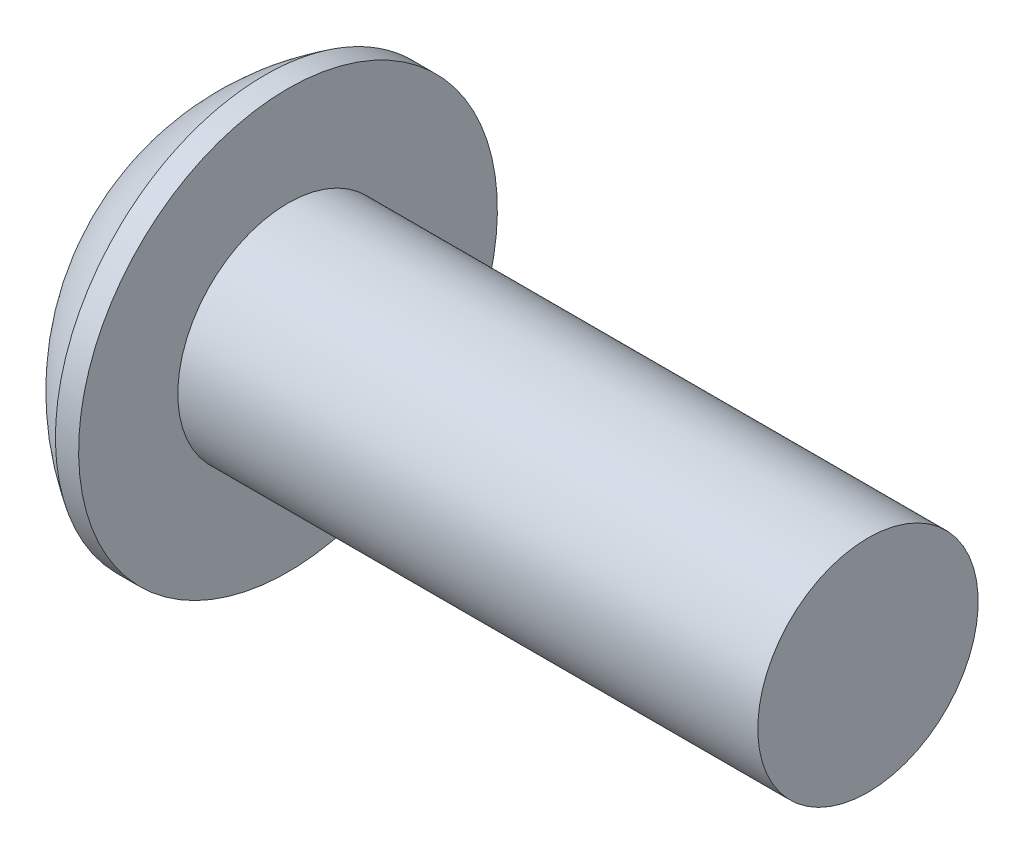
ISO-10303-21;
HEADER;
FILE_DESCRIPTION(('STEP AP214'),'2;1');
FILE_NAME('part.step','',(''),(''),'','','');
FILE_SCHEMA(('AUTOMOTIVE_DESIGN { 1 0 10303 214 1 1 1 1 }'));
ENDSEC;
DATA;
#1=APPLICATION_CONTEXT('core data for automotive mechanical design processes');
#2=APPLICATION_PROTOCOL_DEFINITION('international standard','automotive_design',2000,#1);
#3=PRODUCT_CONTEXT('',#1,'mechanical');
#4=PRODUCT('Part','Part','',(#3));
#5=PRODUCT_RELATED_PRODUCT_CATEGORY('part','',(#4));
#6=PRODUCT_DEFINITION_FORMATION('','',#4);
#7=PRODUCT_DEFINITION_CONTEXT('part definition',#1,'design');
#8=PRODUCT_DEFINITION('design','',#6,#7);
#9=PRODUCT_DEFINITION_SHAPE('','',#8);
#10=(LENGTH_UNIT() NAMED_UNIT(*) SI_UNIT(.MILLI.,.METRE.));
#11=(NAMED_UNIT(*) PLANE_ANGLE_UNIT() SI_UNIT($,.RADIAN.));
#12=(NAMED_UNIT(*) SI_UNIT($,.STERADIAN.) SOLID_ANGLE_UNIT());
#13=UNCERTAINTY_MEASURE_WITH_UNIT(LENGTH_MEASURE(1.E-05),#10,'distance_accuracy_value','');
#14=(GEOMETRIC_REPRESENTATION_CONTEXT(3) GLOBAL_UNCERTAINTY_ASSIGNED_CONTEXT((#13)) GLOBAL_UNIT_ASSIGNED_CONTEXT((#10,
#11,#12)) REPRESENTATION_CONTEXT('',''));
#15=CARTESIAN_POINT('',(0.,0.,0.));
#16=DIRECTION('',(0.,0.,1.));
#17=DIRECTION('',(1.,0.,0.));
#18=AXIS2_PLACEMENT_3D('',#15,#16,#17);
#19=CARTESIAN_POINT('',(-0.533400000000002,0.,0.));
#20=DIRECTION('',(-1.,0.,0.));
#21=DIRECTION('',(0.,0.,1.));
#22=AXIS2_PLACEMENT_3D('',#19,#20,#21);
#23=PLANE('',#22);
#24=DIRECTION('',(0.,0.5,0.866025403784439));
#25=VECTOR('',#24,1.);
#26=CARTESIAN_POINT('',(-0.533400000000002,1.83308710467706,0.));
#27=LINE('',#26,#25);
#28=CARTESIAN_POINT('',(-0.533400000000002,1.83308710467706,0.));
#29=VERTEX_POINT('',#28);
#30=CARTESIAN_POINT('',(-0.533400000000002,0.916543552338531,-1.5875));
#31=VERTEX_POINT('',#30);
#32=EDGE_CURVE('E116',#29,#31,#27,.F.);
#33=ORIENTED_EDGE('',*,*,#32,.T.);
#34=DIRECTION('',(0.,1.,0.));
#35=VECTOR('',#34,1.);
#36=CARTESIAN_POINT('',(-0.533400000000002,0.916543552338531,-1.5875));
#37=LINE('',#36,#35);
#38=CARTESIAN_POINT('',(-0.533400000000002,-0.916543552338531,-1.5875));
#39=VERTEX_POINT('',#38);
#40=EDGE_CURVE('E83',#31,#39,#37,.F.);
#41=ORIENTED_EDGE('',*,*,#40,.T.);
#42=DIRECTION('',(0.,0.5,-0.866025403784439));
#43=VECTOR('',#42,1.);
#44=CARTESIAN_POINT('',(-0.533400000000002,-0.916543552338531,-1.5875));
#45=LINE('',#44,#43);
#46=CARTESIAN_POINT('',(-0.533400000000002,-1.83308710467706,0.));
#47=VERTEX_POINT('',#46);
#48=EDGE_CURVE('E85',#39,#47,#45,.F.);
#49=ORIENTED_EDGE('',*,*,#48,.T.);
#50=DIRECTION('',(0.,-0.5,-0.866025403784439));
#51=VECTOR('',#50,1.);
#52=CARTESIAN_POINT('',(-0.533400000000002,-1.83308710467706,0.));
#53=LINE('',#52,#51);
#54=CARTESIAN_POINT('',(-0.533400000000002,-0.916543552338533,1.5875));
#55=VERTEX_POINT('',#54);
#56=EDGE_CURVE('E86',#47,#55,#53,.F.);
#57=ORIENTED_EDGE('',*,*,#56,.T.);
#58=DIRECTION('',(0.,-1.,0.));
#59=VECTOR('',#58,1.);
#60=CARTESIAN_POINT('',(-0.533400000000002,-0.916543552338532,1.5875));
#61=LINE('',#60,#59);
#62=CARTESIAN_POINT('',(-0.533400000000002,0.916543552338531,1.5875));
#63=VERTEX_POINT('',#62);
#64=EDGE_CURVE('E72',#55,#63,#61,.F.);
#65=ORIENTED_EDGE('',*,*,#64,.T.);
#66=DIRECTION('',(0.,-0.5,0.866025403784439));
#67=VECTOR('',#66,1.);
#68=CARTESIAN_POINT('',(-0.533400000000002,0.916543552338531,1.5875));
#69=LINE('',#68,#67);
#70=EDGE_CURVE('E111',#63,#29,#69,.F.);
#71=ORIENTED_EDGE('',*,*,#70,.T.);
#72=EDGE_LOOP('',(#33,#41,#49,#57,#65,#71));
#73=FACE_BOUND('',#72,.T.);
#74=ADVANCED_FACE('F17',(#73),#23,.T.);
#75=CARTESIAN_POINT('',(-0.533400000000002,-1.83308710467706,0.));
#76=DIRECTION('',(0.,-0.866025403784439,0.5));
#77=DIRECTION('',(0.,-0.5,-0.866025403784439));
#78=AXIS2_PLACEMENT_3D('',#75,#76,#77);
#79=PLANE('',#78);
#80=CARTESIAN_POINT('',(-2.56539999994394,-1.8330871046745,-2.00804498786736E-11));
#81=CARTESIAN_POINT('',(-2.53392818229741,-1.80158505518366,0.0545631502562923));
#82=CARTESIAN_POINT('',(-2.5043050627177,-1.76955629074211,0.110038597579172));
#83=CARTESIAN_POINT('',(-2.45006639539122,-1.70424635317817,0.223158727683824));
#84=CARTESIAN_POINT('',(-2.42548101615987,-1.6709589724711,0.280814162317604));
#85=CARTESIAN_POINT('',(-2.38336609605347,-1.60383660211837,0.397073518091736));
#86=CARTESIAN_POINT('',(-2.36573072948629,-1.57001869730198,0.455647847439699));
#87=CARTESIAN_POINT('',(-2.33856008862263,-1.50163859306838,0.574085662199493));
#88=CARTESIAN_POINT('',(-2.32900454007239,-1.46707848106388,0.633945532106421));
#89=CARTESIAN_POINT('',(-2.32038274183869,-1.40751253669323,0.737116774157155));
#90=CARTESIAN_POINT('',(-2.31910682172836,-1.38258360390154,0.780294952330845));
#91=CARTESIAN_POINT('',(-2.32125913780735,-1.33276652395073,0.866580665890379));
#92=CARTESIAN_POINT('',(-2.32468902284537,-1.30787839414808,0.90968817121394));
#93=CARTESIAN_POINT('',(-2.33605631415915,-1.25834345643267,0.995485200086784));
#94=CARTESIAN_POINT('',(-2.34399762019329,-1.23369687609494,1.03817432946455));
#95=CARTESIAN_POINT('',(-2.36395627681902,-1.18481740842653,1.12283605091316));
#96=CARTESIAN_POINT('',(-2.37597537628367,-1.16058470328902,1.16480832741616));
#97=CARTESIAN_POINT('',(-2.41164383187845,-1.09853862948576,1.27227527965358));
#98=CARTESIAN_POINT('',(-2.43797770752625,-1.06110942924036,1.33710455616529));
#99=CARTESIAN_POINT('',(-2.48243061452926,-1.00607390269188,1.43242888436855));
#100=CARTESIAN_POINT('',(-2.49804835924321,-0.987937988038022,1.46384120999077));
#101=CARTESIAN_POINT('',(-2.53070945051393,-0.951999508520197,1.52608848246242));
#102=CARTESIAN_POINT('',(-2.54775211871235,-0.934196789917587,1.55692369559499));
#103=CARTESIAN_POINT('',(-2.56539999993807,-0.916543552329633,1.58750000001541));
#104=B_SPLINE_CURVE_WITH_KNOTS('',3,(#80,#81,#82,#83,#84,#85,#86,#87,#88,#89,#90,#91,#92,#93,
#94,#95,#96,#97,#98,#99,#100,#101,#102,#103),.UNSPECIFIED.,.F.,.F.,(4,2,2,2,2,2,2,2,2,2,2,4),
(0.,0.211427927732169,0.424087197148228,0.633370156422424,0.842126401515785,0.991537201098734,
1.14100036552056,1.29059292577265,1.44024972414947,1.67781721417335,1.79627069411587,
1.91466809995991),.UNSPECIFIED.);
#105=CARTESIAN_POINT('',(-2.56539999993857,-1.83308710468646,0.));
#106=VERTEX_POINT('',#105);
#107=CARTESIAN_POINT('',(-2.56539999993106,-0.916543552342318,1.5875));
#108=VERTEX_POINT('',#107);
#109=EDGE_CURVE('E20',#106,#108,#104,.T.);
#110=ORIENTED_EDGE('',*,*,#109,.T.);
#111=DIRECTION('',(1.,0.,0.));
#112=VECTOR('',#111,1.);
#113=CARTESIAN_POINT('',(-0.533400000000002,-0.916543552338533,1.5875));
#114=LINE('',#113,#112);
#115=EDGE_CURVE('E91',#108,#55,#114,.T.);
#116=ORIENTED_EDGE('',*,*,#115,.T.);
#117=ORIENTED_EDGE('',*,*,#56,.F.);
#118=DIRECTION('',(1.,0.,0.));
#119=VECTOR('',#118,1.);
#120=CARTESIAN_POINT('',(-0.533400000000002,-1.83308710467706,0.));
#121=LINE('',#120,#119);
#122=EDGE_CURVE('E59',#47,#106,#121,.F.);
#123=ORIENTED_EDGE('',*,*,#122,.T.);
#124=EDGE_LOOP('',(#110,#116,#117,#123));
#125=FACE_BOUND('',#124,.T.);
#126=ADVANCED_FACE('F90',(#125),#79,.F.);
#127=CARTESIAN_POINT('',(-0.533400000000002,-0.916543552338531,-1.5875));
#128=DIRECTION('',(0.,-0.866025403784439,-0.5));
#129=DIRECTION('',(0.,0.5,-0.866025403784439));
#130=AXIS2_PLACEMENT_3D('',#127,#128,#129);
#131=PLANE('',#130);
#132=CARTESIAN_POINT('',(-2.56539999994527,-0.916543552319403,-1.58750000001409));
#133=CARTESIAN_POINT('',(-2.53392818229919,-0.948045601822691,-1.53293684974403));
#134=CARTESIAN_POINT('',(-2.50430506271949,-0.980074366269487,-1.47746140242354));
#135=CARTESIAN_POINT('',(-2.45006639539264,-1.04538430383757,-1.36434127232016));
#136=CARTESIAN_POINT('',(-2.42548101616093,-1.07867168454351,-1.30668583768523));
#137=CARTESIAN_POINT('',(-2.38336609605398,-1.14579405489574,-1.19042648190974));
#138=CARTESIAN_POINT('',(-2.36573072948662,-1.17961195971273,-1.13185215256154));
#139=CARTESIAN_POINT('',(-2.3385600886227,-1.2479920639471,-1.013414337801));
#140=CARTESIAN_POINT('',(-2.32900454007237,-1.28255217595175,-0.953554467893575));
#141=CARTESIAN_POINT('',(-2.32038274183866,-1.34211812032265,-0.850383225842316));
#142=CARTESIAN_POINT('',(-2.31910682172835,-1.36704705311438,-0.807205047668587));
#143=CARTESIAN_POINT('',(-2.32125913780739,-1.41686413306525,-0.720919334108961));
#144=CARTESIAN_POINT('',(-2.32468902284544,-1.44175226286793,-0.67781182878535));
#145=CARTESIAN_POINT('',(-2.33605631415929,-1.49128720058339,-0.592014799912417));
#146=CARTESIAN_POINT('',(-2.34399762019345,-1.51593378092113,-0.54932567053461));
#147=CARTESIAN_POINT('',(-2.36395627681926,-1.56481324858959,-0.464663949085931));
#148=CARTESIAN_POINT('',(-2.37597537628395,-1.58904595372712,-0.422691672582891));
#149=CARTESIAN_POINT('',(-2.41164383187876,-1.65109202753029,-0.315224720345625));
#150=CARTESIAN_POINT('',(-2.43797770752652,-1.6885212277756,-0.250395443834082));
#151=CARTESIAN_POINT('',(-2.48243061452944,-1.74355675432393,-0.15507111563107));
#152=CARTESIAN_POINT('',(-2.49804835924337,-1.76169266897775,-0.123658790008927));
#153=CARTESIAN_POINT('',(-2.53070945051401,-1.79763114849548,-0.0614115175374324));
#154=CARTESIAN_POINT('',(-2.5477521187124,-1.81543386709805,-0.0305763044049344));
#155=CARTESIAN_POINT('',(-2.56539999993807,-1.83308710468596,1.54136844652939E-11));
#156=B_SPLINE_CURVE_WITH_KNOTS('',3,(#132,#133,#134,#135,#136,#137,#138,#139,#140,#141,#142,
#143,#144,#145,#146,#147,#148,#149,#150,#151,#152,#153,#154,#155),.UNSPECIFIED.,.F.,.F.,(4,2,2,
2,2,2,2,2,2,2,2,4),(0.,0.211427927733669,0.424087197151313,0.633370156427101,0.842126401522016,
0.99153720110513,1.14100036552713,1.29059292577937,1.44024972415633,1.67781721417961,
1.79627069412184,1.9146680999656),.UNSPECIFIED.);
#157=CARTESIAN_POINT('',(-2.56539999995198,-0.916543552351339,-1.58750000002218));
#158=VERTEX_POINT('',#157);
#159=EDGE_CURVE('E95',#158,#106,#156,.T.);
#160=ORIENTED_EDGE('',*,*,#159,.T.);
#161=ORIENTED_EDGE('',*,*,#122,.F.);
#162=ORIENTED_EDGE('',*,*,#48,.F.);
#163=DIRECTION('',(-1.,0.,0.));
#164=VECTOR('',#163,1.);
#165=CARTESIAN_POINT('',(-0.533400000000002,-0.916543552338531,-1.5875));
#166=LINE('',#165,#164);
#167=EDGE_CURVE('E97',#39,#158,#166,.T.);
#168=ORIENTED_EDGE('',*,*,#167,.T.);
#169=EDGE_LOOP('',(#160,#161,#162,#168));
#170=FACE_BOUND('',#169,.T.);
#171=ADVANCED_FACE('F93',(#170),#131,.F.);
#172=CARTESIAN_POINT('',(-0.533400000000002,0.916543552338531,-1.5875));
#173=DIRECTION('',(0.,0.,-1.));
#174=DIRECTION('',(-1.,0.,0.));
#175=AXIS2_PLACEMENT_3D('',#172,#173,#174);
#176=PLANE('',#175);
#177=CARTESIAN_POINT('',(-2.56539999994527,0.916543552360294,-1.58749999999048));
#178=CARTESIAN_POINT('',(-2.53392818229821,0.853539453376781,-1.58749999999657));
#179=CARTESIAN_POINT('',(-2.50430506271702,0.789481924500113,-1.58749999999908));
#180=CARTESIAN_POINT('',(-2.45006639538581,0.658862049392287,-1.58750000000093));
#181=CARTESIAN_POINT('',(-2.42548101615122,0.59228728799181,-1.58750000000025));
#182=CARTESIAN_POINT('',(-2.38336609603683,0.458042547310979,-1.58749999999976));
#183=CARTESIAN_POINT('',(-2.36573072946494,0.390406737689213,-1.58749999999994));
#184=CARTESIAN_POINT('',(-2.3385600885904,0.253646529243895,-1.58750000000006));
#185=CARTESIAN_POINT('',(-2.32900454003397,0.184526305245804,-1.58750000000001));
#186=CARTESIAN_POINT('',(-2.32038274178942,0.0653944165301613,-1.58749999999999));
#187=CARTESIAN_POINT('',(-2.31910682167392,0.0155365509618711,-1.5875));
#188=CARTESIAN_POINT('',(-2.3212591377409,-0.0840976089101244,-1.5875));
#189=CARTESIAN_POINT('',(-2.32468902277208,-0.133873868500894,-1.5875));
#190=CARTESIAN_POINT('',(-2.33605631407098,-0.2329437439033,-1.5875));
#191=CARTESIAN_POINT('',(-2.34399762009707,-0.282236904564879,-1.5875));
#192=CARTESIAN_POINT('',(-2.36395627670599,-0.379995839874564,-1.5875));
#193=CARTESIAN_POINT('',(-2.37597537616188,-0.428461250136325,-1.5875));
#194=CARTESIAN_POINT('',(-2.41164383175616,-0.552553397787632,-1.5875));
#195=CARTESIAN_POINT('',(-2.43797770742117,-0.627411798334259,-1.5875));
#196=CARTESIAN_POINT('',(-2.48243061445881,-0.737482851511091,-1.5875));
#197=CARTESIAN_POINT('',(-2.49804835918582,-0.773754680844889,-1.5875));
#198=CARTESIAN_POINT('',(-2.53070945048496,-0.845631639931401,-1.5875));
#199=CARTESIAN_POINT('',(-2.54775211869874,-0.881237077161412,-1.5875));
#200=CARTESIAN_POINT('',(-2.56539999994071,-0.916543552361606,-1.5875));
#201=B_SPLINE_CURVE_WITH_KNOTS('',3,(#177,#178,#179,#180,#181,#182,#183,#184,#185,#186,#187,
#188,#189,#190,#191,#192,#193,#194,#195,#196,#197,#198,#199,#200),.UNSPECIFIED.,.F.,.F.,(4,2,2,
2,2,2,2,2,2,2,2,4),(0.,0.211427927701375,0.424087197086717,0.633370156331471,0.842126401395377,
0.991537200933545,1.14100036531054,1.29059292551773,1.44024972384963,1.677817214047,
1.79627069407681,1.91466810000777),.UNSPECIFIED.);
#202=CARTESIAN_POINT('',(-2.56539999995198,0.916543552337129,-1.58749999999757));
#203=VERTEX_POINT('',#202);
#204=EDGE_CURVE('E203',#203,#158,#201,.T.);
#205=ORIENTED_EDGE('',*,*,#204,.T.);
#206=ORIENTED_EDGE('',*,*,#167,.F.);
#207=ORIENTED_EDGE('',*,*,#40,.F.);
#208=DIRECTION('',(1.,0.,0.));
#209=VECTOR('',#208,1.);
#210=CARTESIAN_POINT('',(-0.533400000000002,0.916543552338531,-1.5875));
#211=LINE('',#210,#209);
#212=EDGE_CURVE('E113',#31,#203,#211,.F.);
#213=ORIENTED_EDGE('',*,*,#212,.T.);
#214=EDGE_LOOP('',(#205,#206,#207,#213));
#215=FACE_BOUND('',#214,.T.);
#216=ADVANCED_FACE('F192',(#215),#176,.F.);
#217=CARTESIAN_POINT('',(-0.533400000000002,1.83308710467706,0.));
#218=DIRECTION('',(0.,0.866025403784439,-0.5));
#219=DIRECTION('',(0.,0.5,0.866025403784439));
#220=AXIS2_PLACEMENT_3D('',#217,#218,#219);
#221=PLANE('',#220);
#222=CARTESIAN_POINT('',(-2.56539999994394,1.8330871046745,2.00800374309997E-11));
#223=CARTESIAN_POINT('',(-2.5339281822974,1.80158505518366,-0.0545631502562965));
#224=CARTESIAN_POINT('',(-2.5043050627177,1.76955629074211,-0.11003859757918));
#225=CARTESIAN_POINT('',(-2.45006639539121,1.70424635317816,-0.22315872768384));
#226=CARTESIAN_POINT('',(-2.42548101615987,1.67095897247109,-0.280814162317626));
#227=CARTESIAN_POINT('',(-2.38336609605347,1.60383660211835,-0.397073518091758));
#228=CARTESIAN_POINT('',(-2.36573072948628,1.57001869730197,-0.455647847439717));
#229=CARTESIAN_POINT('',(-2.33856008862263,1.50163859306837,-0.574085662199503));
#230=CARTESIAN_POINT('',(-2.32900454007239,1.46707848106388,-0.633945532106426));
#231=CARTESIAN_POINT('',(-2.32038274183869,1.40751253669322,-0.737116774157154));
#232=CARTESIAN_POINT('',(-2.31910682172836,1.38258360390154,-0.780294952330843));
#233=CARTESIAN_POINT('',(-2.32125913780735,1.33276652395073,-0.866580665890374));
#234=CARTESIAN_POINT('',(-2.32468902284537,1.30787839414808,-0.909688171213933));
#235=CARTESIAN_POINT('',(-2.33605631415915,1.25834345643267,-0.995485200086777));
#236=CARTESIAN_POINT('',(-2.34399762019328,1.23369687609495,-1.03817432946455));
#237=CARTESIAN_POINT('',(-2.36395627681902,1.18481740842653,-1.12283605091316));
#238=CARTESIAN_POINT('',(-2.37597537628367,1.16058470328902,-1.16480832741616));
#239=CARTESIAN_POINT('',(-2.41164383187872,1.09853862948529,-1.2722752796544));
#240=CARTESIAN_POINT('',(-2.43797770752691,1.06110942923942,-1.33710455616691));
#241=CARTESIAN_POINT('',(-2.48243061453059,1.00607390269029,-1.43242888437131));
#242=CARTESIAN_POINT('',(-2.49804835924479,0.987937988036214,-1.4638412099939));
#243=CARTESIAN_POINT('',(-2.53070945051602,0.951999508517968,-1.52608848246628));
#244=CARTESIAN_POINT('',(-2.54775211871471,0.934196789915152,-1.55692369559921));
#245=CARTESIAN_POINT('',(-2.56539999994071,0.916543552326994,-1.58750000001998));
#246=B_SPLINE_CURVE_WITH_KNOTS('',3,(#222,#223,#224,#225,#226,#227,#228,#229,#230,#231,#232,
#233,#234,#235,#236,#237,#238,#239,#240,#241,#242,#243,#244,#245),.UNSPECIFIED.,.F.,.F.,(4,2,2,
2,2,2,2,2,2,2,2,4),(0.,0.211427927732185,0.424087197148259,0.63337015642244,0.842126401515786,
0.99153720109873,1.14100036552055,1.29059292577265,1.44024972414947,1.67781721417631,
1.7962706941203,1.9146680999658),.UNSPECIFIED.);
#247=CARTESIAN_POINT('',(-2.56539999993857,1.83308710468646,0.));
#248=VERTEX_POINT('',#247);
#249=EDGE_CURVE('E196',#248,#203,#246,.T.);
#250=ORIENTED_EDGE('',*,*,#249,.T.);
#251=ORIENTED_EDGE('',*,*,#212,.F.);
#252=ORIENTED_EDGE('',*,*,#32,.F.);
#253=DIRECTION('',(1.,0.,0.));
#254=VECTOR('',#253,1.);
#255=CARTESIAN_POINT('',(-0.533400000000002,1.83308710467706,0.));
#256=LINE('',#255,#254);
#257=EDGE_CURVE('E108',#29,#248,#256,.F.);
#258=ORIENTED_EDGE('',*,*,#257,.T.);
#259=EDGE_LOOP('',(#250,#251,#252,#258));
#260=FACE_BOUND('',#259,.T.);
#261=ADVANCED_FACE('F188',(#260),#221,.F.);
#262=CARTESIAN_POINT('',(-0.533400000000002,0.916543552338531,1.5875));
#263=DIRECTION('',(0.,0.866025403784439,0.5));
#264=DIRECTION('',(0.,-0.5,0.866025403784439));
#265=AXIS2_PLACEMENT_3D('',#262,#263,#264);
#266=PLANE('',#265);
#267=CARTESIAN_POINT('',(-2.56539999994394,0.91654355231986,1.58750000000782));
#268=CARTESIAN_POINT('',(-2.53392818229741,0.948045601824288,1.5329368497393));
#269=CARTESIAN_POINT('',(-2.5043050627177,0.980074366271431,1.47746140241964));
#270=CARTESIAN_POINT('',(-2.45006639539122,1.04538430383949,1.36434127231737));
#271=CARTESIAN_POINT('',(-2.42548101615987,1.07867168454504,1.30668583768271));
#272=CARTESIAN_POINT('',(-2.38336609605347,1.14579405489669,1.19042648190795));
#273=CARTESIAN_POINT('',(-2.36573072948629,1.17961195971347,1.13185215256022));
#274=CARTESIAN_POINT('',(-2.33856008862263,1.24799206394736,1.01341433780059));
#275=CARTESIAN_POINT('',(-2.32900454007239,1.28255217595174,0.953554467893597));
#276=CARTESIAN_POINT('',(-2.32038274183869,1.34211812032234,0.850383225842832));
#277=CARTESIAN_POINT('',(-2.31910682172836,1.36704705311405,0.807205047669152));
#278=CARTESIAN_POINT('',(-2.32125913780735,1.41686413306487,0.720919334109624));
#279=CARTESIAN_POINT('',(-2.32468902284537,1.44175226286752,0.677811828786061));
#280=CARTESIAN_POINT('',(-2.33605631415915,1.49128720058292,0.592014799913215));
#281=CARTESIAN_POINT('',(-2.34399762019328,1.51593378092065,0.549325670535446));
#282=CARTESIAN_POINT('',(-2.36395627681902,1.56481324858906,0.464663949086841));
#283=CARTESIAN_POINT('',(-2.37597537628367,1.58904595372657,0.422691672583837));
#284=CARTESIAN_POINT('',(-2.41164383187845,1.65109202752983,0.315224720346425));
#285=CARTESIAN_POINT('',(-2.43797770752625,1.68852122777524,0.250395443834706));
#286=CARTESIAN_POINT('',(-2.48243061452926,1.74355675432371,0.155071115631445));
#287=CARTESIAN_POINT('',(-2.49804835924321,1.76169266897757,0.123658790009225));
#288=CARTESIAN_POINT('',(-2.53070945051393,1.7976311484954,0.0614115175375789));
#289=CARTESIAN_POINT('',(-2.54775211871235,1.81543386709801,0.0305763044050067));
#290=CARTESIAN_POINT('',(-2.56539999993807,1.83308710468596,-1.54142580803093E-11));
#291=B_SPLINE_CURVE_WITH_KNOTS('',3,(#267,#268,#269,#270,#271,#272,#273,#274,#275,#276,#277,
#278,#279,#280,#281,#282,#283,#284,#285,#286,#287,#288,#289,#290),.UNSPECIFIED.,.F.,.F.,(4,2,2,
2,2,2,2,2,2,2,2,4),(0.,0.211427927732169,0.424087197148227,0.633370156422423,0.842126401515785,
0.991537201098733,1.14100036552056,1.29059292577265,1.44024972414946,1.67781721417335,
1.79627069411587,1.91466809995991),.UNSPECIFIED.);
#292=CARTESIAN_POINT('',(-2.56539999993857,0.91654355234323,1.58750000000814));
#293=VERTEX_POINT('',#292);
#294=EDGE_CURVE('E169',#293,#248,#291,.T.);
#295=ORIENTED_EDGE('',*,*,#294,.T.);
#296=ORIENTED_EDGE('',*,*,#257,.F.);
#297=ORIENTED_EDGE('',*,*,#70,.F.);
#298=DIRECTION('',(1.,0.,0.));
#299=VECTOR('',#298,1.);
#300=CARTESIAN_POINT('',(-0.533400000000002,0.916543552338531,1.5875));
#301=LINE('',#300,#299);
#302=EDGE_CURVE('E40',#63,#293,#301,.F.);
#303=ORIENTED_EDGE('',*,*,#302,.T.);
#304=EDGE_LOOP('',(#295,#296,#297,#303));
#305=FACE_BOUND('',#304,.T.);
#306=ADVANCED_FACE('F181',(#305),#266,.F.);
#307=CARTESIAN_POINT('',(-0.533400000000002,-0.916543552338532,1.5875));
#308=DIRECTION('',(0.,0.,1.));
#309=DIRECTION('',(0.,-1.,0.));
#310=AXIS2_PLACEMENT_3D('',#307,#308,#309);
#311=PLANE('',#310);
#312=CARTESIAN_POINT('',(-2.56539999994394,-0.916543552354642,1.58749999998774));
#313=CARTESIAN_POINT('',(-2.53392818229741,-0.853539453359365,1.58749999999559));
#314=CARTESIAN_POINT('',(-2.50430506271771,-0.789481924470656,1.58749999999882));
#315=CARTESIAN_POINT('',(-2.45006639539122,-0.658862049338629,1.58750000000119));
#316=CARTESIAN_POINT('',(-2.42548101615988,-0.592287287925995,1.58750000000032));
#317=CARTESIAN_POINT('',(-2.38336609605349,-0.458042547221593,1.58749999999969));
#318=CARTESIAN_POINT('',(-2.36573072948631,-0.390406737588416,1.58749999999992));
#319=CARTESIAN_POINT('',(-2.33856008862266,-0.253646529120892,1.58750000000008));
#320=CARTESIAN_POINT('',(-2.32900454007243,-0.184526305112002,1.58750000000002));
#321=CARTESIAN_POINT('',(-2.32038274183874,-0.0653944163707189,1.58749999999999));
#322=CARTESIAN_POINT('',(-2.31910682172841,-0.0155365507873145,1.5875));
#323=CARTESIAN_POINT('',(-2.32125913780742,0.0840976091143437,1.5875));
#324=CARTESIAN_POINT('',(-2.32468902284545,0.133873868719661,1.5875));
#325=CARTESIAN_POINT('',(-2.33605631415924,0.232943744150505,1.5875));
#326=CARTESIAN_POINT('',(-2.34399762019338,0.282236904825971,1.5875));
#327=CARTESIAN_POINT('',(-2.36395627681913,0.379995840162817,1.5875));
#328=CARTESIAN_POINT('',(-2.37597537628379,0.428461250437851,1.5875));
#329=CARTESIAN_POINT('',(-2.41164383187857,0.552553398044325,1.5875));
#330=CARTESIAN_POINT('',(-2.43797770752636,0.627411798535088,1.5875));
#331=CARTESIAN_POINT('',(-2.48243061452933,0.737482851631955,1.5875));
#332=CARTESIAN_POINT('',(-2.49804835924327,0.773754680939651,1.5875));
#333=CARTESIAN_POINT('',(-2.53070945051396,0.84563163997525,1.5875));
#334=CARTESIAN_POINT('',(-2.54775211871237,0.881237077180446,1.5875));
#335=CARTESIAN_POINT('',(-2.56539999993807,0.91654355235633,1.5875));
#336=B_SPLINE_CURVE_WITH_KNOTS('',3,(#312,#313,#314,#315,#316,#317,#318,#319,#320,#321,#322,
#323,#324,#325,#326,#327,#328,#329,#330,#331,#332,#333,#334,#335),.UNSPECIFIED.,.F.,.F.,(4,2,2,
2,2,2,2,2,2,2,2,4),(0.,0.211427927732202,0.424087197148294,0.633370156422521,0.842126401515914,
0.991537201098908,1.14100036552078,1.29059292577292,1.44024972414978,1.67781721417349,
1.79627069411592,1.91466809995988),.UNSPECIFIED.);
#337=EDGE_CURVE('E160',#108,#293,#336,.T.);
#338=ORIENTED_EDGE('',*,*,#337,.T.);
#339=ORIENTED_EDGE('',*,*,#302,.F.);
#340=ORIENTED_EDGE('',*,*,#64,.F.);
#341=ORIENTED_EDGE('',*,*,#115,.F.);
#342=EDGE_LOOP('',(#338,#339,#340,#341));
#343=FACE_BOUND('',#342,.T.);
#344=ADVANCED_FACE('F177',(#343),#311,.F.);
#345=CARTESIAN_POINT('',(-2.56540000003724,0.,0.));
#346=DIRECTION('',(-1.,0.,0.));
#347=DIRECTION('',(0.,-1.,0.));
#348=AXIS2_PLACEMENT_3D('',#345,#346,#347);
#349=CONICAL_SURFACE('',#348,1.83308710478514,0.78539816351237);
#350=ORIENTED_EDGE('',*,*,#109,.F.);
#351=CARTESIAN_POINT('',(-2.56539999992356,0.,0.));
#352=DIRECTION('',(-1.,0.,0.));
#353=DIRECTION('',(0.,-1.,0.));
#354=AXIS2_PLACEMENT_3D('',#351,#352,#353);
#355=CIRCLE('',#354,1.83308710467145);
#356=EDGE_CURVE('E168',#108,#106,#355,.F.);
#357=ORIENTED_EDGE('',*,*,#356,.F.);
#358=EDGE_LOOP('',(#350,#357));
#359=FACE_BOUND('',#358,.T.);
#360=ADVANCED_FACE('F180',(#359),#349,.F.);
#361=CARTESIAN_POINT('',(-2.56540000003724,0.,0.));
#362=DIRECTION('',(-1.,0.,0.));
#363=DIRECTION('',(0.,-1.,0.));
#364=AXIS2_PLACEMENT_3D('',#361,#362,#363);
#365=CONICAL_SURFACE('',#364,1.83308710478514,0.78539816351237);
#366=ORIENTED_EDGE('',*,*,#159,.F.);
#367=CARTESIAN_POINT('',(-2.56539999992356,0.,0.));
#368=DIRECTION('',(-1.,0.,0.));
#369=DIRECTION('',(0.,-1.,0.));
#370=AXIS2_PLACEMENT_3D('',#367,#368,#369);
#371=CIRCLE('',#370,1.83308710467145);
#372=EDGE_CURVE('E279',#106,#158,#371,.F.);
#373=ORIENTED_EDGE('',*,*,#372,.F.);
#374=EDGE_LOOP('',(#366,#373));
#375=FACE_BOUND('',#374,.T.);
#376=ADVANCED_FACE('F216',(#375),#365,.F.);
#377=CARTESIAN_POINT('',(-2.56540000003724,0.,0.));
#378=DIRECTION('',(-1.,0.,0.));
#379=DIRECTION('',(0.,-1.,0.));
#380=AXIS2_PLACEMENT_3D('',#377,#378,#379);
#381=CONICAL_SURFACE('',#380,1.83308710478514,0.785398163397448);
#382=ORIENTED_EDGE('',*,*,#204,.F.);
#383=CARTESIAN_POINT('',(-2.5653999999804,0.,0.));
#384=DIRECTION('',(-1.,0.,0.));
#385=DIRECTION('',(0.,-1.,0.));
#386=AXIS2_PLACEMENT_3D('',#383,#384,#385);
#387=CIRCLE('',#386,1.83308710472829);
#388=EDGE_CURVE('E276',#158,#203,#387,.F.);
#389=ORIENTED_EDGE('',*,*,#388,.F.);
#390=EDGE_LOOP('',(#382,#389));
#391=FACE_BOUND('',#390,.T.);
#392=ADVANCED_FACE('F212',(#391),#381,.F.);
#393=CARTESIAN_POINT('',(-2.56540000003724,0.,0.));
#394=DIRECTION('',(-1.,0.,0.));
#395=DIRECTION('',(0.,-1.,0.));
#396=AXIS2_PLACEMENT_3D('',#393,#394,#395);
#397=CONICAL_SURFACE('',#396,1.83308710478514,0.78539816351237);
#398=ORIENTED_EDGE('',*,*,#249,.F.);
#399=CARTESIAN_POINT('',(-2.56539999992356,0.,0.));
#400=DIRECTION('',(-1.,0.,0.));
#401=DIRECTION('',(0.,-1.,0.));
#402=AXIS2_PLACEMENT_3D('',#399,#400,#401);
#403=CIRCLE('',#402,1.83308710467145);
#404=EDGE_CURVE('E273',#203,#248,#403,.F.);
#405=ORIENTED_EDGE('',*,*,#404,.F.);
#406=EDGE_LOOP('',(#398,#405));
#407=FACE_BOUND('',#406,.T.);
#408=ADVANCED_FACE('F209',(#407),#397,.F.);
#409=CARTESIAN_POINT('',(-2.56540000003724,0.,0.));
#410=DIRECTION('',(-1.,0.,0.));
#411=DIRECTION('',(0.,-1.,0.));
#412=AXIS2_PLACEMENT_3D('',#409,#410,#411);
#413=CONICAL_SURFACE('',#412,1.83308710478514,0.78539816351237);
#414=ORIENTED_EDGE('',*,*,#294,.F.);
#415=CARTESIAN_POINT('',(-2.56539999992356,0.,0.));
#416=DIRECTION('',(-1.,0.,0.));
#417=DIRECTION('',(0.,-1.,0.));
#418=AXIS2_PLACEMENT_3D('',#415,#416,#417);
#419=CIRCLE('',#418,1.83308710467145);
#420=EDGE_CURVE('E268',#248,#293,#419,.F.);
#421=ORIENTED_EDGE('',*,*,#420,.F.);
#422=EDGE_LOOP('',(#414,#421));
#423=FACE_BOUND('',#422,.T.);
#424=ADVANCED_FACE('F155',(#423),#413,.F.);
#425=CARTESIAN_POINT('',(-2.56540000003724,0.,0.));
#426=DIRECTION('',(-1.,0.,0.));
#427=DIRECTION('',(0.,-1.,0.));
#428=AXIS2_PLACEMENT_3D('',#425,#426,#427);
#429=CONICAL_SURFACE('',#428,1.83308710478514,0.785398163512485);
#430=ORIENTED_EDGE('',*,*,#337,.F.);
#431=CARTESIAN_POINT('',(-2.56539999992356,0.,0.));
#432=DIRECTION('',(-1.,0.,0.));
#433=DIRECTION('',(0.,-1.,0.));
#434=AXIS2_PLACEMENT_3D('',#431,#432,#433);
#435=CIRCLE('',#434,1.83308710467145);
#436=EDGE_CURVE('E140',#293,#108,#435,.F.);
#437=ORIENTED_EDGE('',*,*,#436,.F.);
#438=EDGE_LOOP('',(#430,#437));
#439=FACE_BOUND('',#438,.T.);
#440=ADVANCED_FACE('F150',(#439),#429,.F.);
#441=CARTESIAN_POINT('',(-2.5654,0.,0.));
#442=DIRECTION('',(-1.,0.,0.));
#443=DIRECTION('',(0.,-1.,0.));
#444=AXIS2_PLACEMENT_3D('',#441,#442,#443);
#445=PLANE('',#444);
#446=CARTESIAN_POINT('',(-2.5654,-2.29235000000002,0.));
#447=CARTESIAN_POINT('',(-2.56540000000001,-2.29234961429958,-0.0643619991867162));
#448=CARTESIAN_POINT('',(-2.56540000000002,-2.28963695190109,-0.128735826629366));
#449=CARTESIAN_POINT('',(-2.56539999999999,-2.27880393843649,-0.257038618985287));
#450=CARTESIAN_POINT('',(-2.56539999999995,-2.27068199085128,-0.320967446929163));
#451=CARTESIAN_POINT('',(-2.56540000000006,-2.24906694794257,-0.448021254607718));
#452=CARTESIAN_POINT('',(-2.56540000000021,-2.23556532653462,-0.511144793381861));
#453=CARTESIAN_POINT('',(-2.56539999999979,-2.20328400495645,-0.636065176149322));
#454=CARTESIAN_POINT('',(-2.56539999999921,-2.18450002159115,-0.697860899533935));
#455=CARTESIAN_POINT('',(-2.56539999999869,-2.12048422735804,-0.88032980292775));
#456=CARTESIAN_POINT('',(-2.56539999999995,-2.0675359907946,-0.99839179592812));
#457=CARTESIAN_POINT('',(-2.56540000000006,-1.94254204858674,-1.22393765942148));
#458=CARTESIAN_POINT('',(-2.56539999999891,-1.87049561696644,-1.33142112758208));
#459=CARTESIAN_POINT('',(-2.56539999999932,-1.74974254194881,-1.48237719670935));
#460=CARTESIAN_POINT('',(-2.56539999999982,-1.70734573132302,-1.53101280076738));
#461=CARTESIAN_POINT('',(-2.56540000000018,-1.6186391029153,-1.62450601319185));
#462=CARTESIAN_POINT('',(-2.56540000000005,-1.57233309727313,-1.66936721890417));
#463=CARTESIAN_POINT('',(-2.56539999999995,-1.47608431707234,-1.7550488420402));
#464=CARTESIAN_POINT('',(-2.56539999999999,-1.42613990458995,-1.79586741981512));
#465=CARTESIAN_POINT('',(-2.56540000000002,-1.32299452541252,-1.87315615311523));
#466=CARTESIAN_POINT('',(-2.56540000000001,-1.26979280714188,-1.90962529930697));
#467=CARTESIAN_POINT('',(-2.56539999999999,-1.10588180153953,-2.0120772215109));
#468=CARTESIAN_POINT('',(-2.5654,-0.990764947001321,-2.07119486286667));
#469=CARTESIAN_POINT('',(-2.5654,-0.752302198839727,-2.16922858468856));
#470=CARTESIAN_POINT('',(-2.5654,-0.628956393121269,-2.2081448809145));
#471=CARTESIAN_POINT('',(-2.5654,-0.377466101733277,-2.2647275576592));
#472=CARTESIAN_POINT('',(-2.5654,-0.249321590440388,-2.28239382469379));
#473=CARTESIAN_POINT('',(-2.5654,0.0081143537161001,-2.29595665980956));
#474=CARTESIAN_POINT('',(-2.5654,0.137405786579698,-2.29185322789073));
#475=CARTESIAN_POINT('',(-2.5654,0.393449386933719,-2.2620096240906));
#476=CARTESIAN_POINT('',(-2.5654,0.520201567981077,-2.23626956775766));
#477=CARTESIAN_POINT('',(-2.5654,0.767645294384444,-2.16383549332687));
#478=CARTESIAN_POINT('',(-2.5654,0.888336774993549,-2.11714125142686));
#479=CARTESIAN_POINT('',(-2.5654,1.06210572146655,-2.03247976453654));
#480=CARTESIAN_POINT('',(-2.5654,1.11884498714066,-2.00180278323696));
#481=CARTESIAN_POINT('',(-2.5654,1.22954062855572,-1.93578011658036));
#482=CARTESIAN_POINT('',(-2.5654,1.28349764565392,-1.9004355139425));
#483=CARTESIAN_POINT('',(-2.5654,1.38821676641537,-1.82534174602348));
#484=CARTESIAN_POINT('',(-2.5654,1.43898030563028,-1.78559458231503));
#485=CARTESIAN_POINT('',(-2.5654,1.53701984534431,-1.70193996292362));
#486=CARTESIAN_POINT('',(-2.5654,1.5842924328055,-1.65802852924127));
#487=CARTESIAN_POINT('',(-2.5654,1.72023903553758,-1.52059650554139));
#488=CARTESIAN_POINT('',(-2.5654,1.80318066138239,-1.42127847626519));
#489=CARTESIAN_POINT('',(-2.5654,1.95118232345098,-1.21011519784664));
#490=CARTESIAN_POINT('',(-2.5654,2.01624303935584,-1.09827042509272));
#491=CARTESIAN_POINT('',(-2.5654,2.09907772661314,-0.923538238005839));
#492=CARTESIAN_POINT('',(-2.5654,2.12425103063558,-0.864058373981966));
#493=CARTESIAN_POINT('',(-2.5654,2.16947990046565,-0.743221562175601));
#494=CARTESIAN_POINT('',(-2.5654,2.18953960800684,-0.681866178863365));
#495=CARTESIAN_POINT('',(-2.5654,2.22438542051156,-0.557786972400356));
#496=CARTESIAN_POINT('',(-2.5654,2.23917985294818,-0.495065478128172));
#497=CARTESIAN_POINT('',(-2.5654,2.26343456384453,-0.368611258323514));
#498=CARTESIAN_POINT('',(-2.5654,2.27289641559285,-0.304878836759566));
#499=CARTESIAN_POINT('',(-2.5654,2.28388649696736,-0.200873029360621));
#500=CARTESIAN_POINT('',(-2.5654,2.28705930623293,-0.160766164180096));
#501=CARTESIAN_POINT('',(-2.5654,2.29129117827044,-0.0804410725432706));
#502=CARTESIAN_POINT('',(-2.5654,2.29235024104238,-0.0402228460869715));
#503=CARTESIAN_POINT('',(-2.56540000000001,2.29234961429956,0.0643619991867166));
#504=CARTESIAN_POINT('',(-2.56540000000002,2.28963695190107,0.128735826629366));
#505=CARTESIAN_POINT('',(-2.56539999999999,2.27880393843648,0.257038618985288));
#506=CARTESIAN_POINT('',(-2.56539999999995,2.27068199085126,0.320967446929163));
#507=CARTESIAN_POINT('',(-2.56540000000006,2.24906694794255,0.448021254607719));
#508=CARTESIAN_POINT('',(-2.56540000000021,2.2355653265346,0.511144793381862));
#509=CARTESIAN_POINT('',(-2.56539999999979,2.20328400495644,0.636065176149322));
#510=CARTESIAN_POINT('',(-2.56539999999921,2.18450002159113,0.697860899533936));
#511=CARTESIAN_POINT('',(-2.56539999999869,2.12048422735802,0.88032980292775));
#512=CARTESIAN_POINT('',(-2.56539999999995,2.06753599079459,0.998391795928119));
#513=CARTESIAN_POINT('',(-2.56540000000006,1.94254204858672,1.22393765942147));
#514=CARTESIAN_POINT('',(-2.56539999999891,1.87049561696642,1.33142112758208));
#515=CARTESIAN_POINT('',(-2.56539999999933,1.7497425419488,1.48237719670935));
#516=CARTESIAN_POINT('',(-2.56539999999982,1.707345731323,1.53101280076738));
#517=CARTESIAN_POINT('',(-2.56540000000018,1.61863910291529,1.62450601319185));
#518=CARTESIAN_POINT('',(-2.56540000000005,1.57233309727312,1.66936721890418));
#519=CARTESIAN_POINT('',(-2.56539999999995,1.47608431707233,1.75504884204021));
#520=CARTESIAN_POINT('',(-2.56539999999999,1.42613990458993,1.79586741981512));
#521=CARTESIAN_POINT('',(-2.56540000000002,1.3229945254125,1.87315615311523));
#522=CARTESIAN_POINT('',(-2.56540000000001,1.26979280714187,1.90962529930697));
#523=CARTESIAN_POINT('',(-2.56539999999999,1.10588180153952,2.0120772215109));
#524=CARTESIAN_POINT('',(-2.5654,0.990764947001304,2.07119486286667));
#525=CARTESIAN_POINT('',(-2.5654,0.75230219883971,2.16922858468856));
#526=CARTESIAN_POINT('',(-2.5654,0.628956393121252,2.2081448809145));
#527=CARTESIAN_POINT('',(-2.5654,0.377466101733262,2.2647275576592));
#528=CARTESIAN_POINT('',(-2.5654,0.249321590440372,2.28239382469379));
#529=CARTESIAN_POINT('',(-2.5654,-0.00811435371611611,2.29595665980955));
#530=CARTESIAN_POINT('',(-2.5654,-0.137405786579714,2.29185322789072));
#531=CARTESIAN_POINT('',(-2.5654,-0.393449386933735,2.2620096240906));
#532=CARTESIAN_POINT('',(-2.5654,-0.520201567981094,2.23626956775766));
#533=CARTESIAN_POINT('',(-2.5654,-0.767645294384462,2.16383549332688));
#534=CARTESIAN_POINT('',(-2.5654,-0.888336774993567,2.11714125142686));
#535=CARTESIAN_POINT('',(-2.5654,-1.06210572146657,2.03247976453654));
#536=CARTESIAN_POINT('',(-2.5654,-1.11884498714068,2.00180278323695));
#537=CARTESIAN_POINT('',(-2.5654,-1.22954062855574,1.93578011658036));
#538=CARTESIAN_POINT('',(-2.5654,-1.28349764565394,1.9004355139425));
#539=CARTESIAN_POINT('',(-2.5654,-1.38821676641539,1.82534174602348));
#540=CARTESIAN_POINT('',(-2.5654,-1.4389803056303,1.78559458231503));
#541=CARTESIAN_POINT('',(-2.5654,-1.53701984534432,1.70193996292362));
#542=CARTESIAN_POINT('',(-2.5654,-1.58429243280552,1.65802852924127));
#543=CARTESIAN_POINT('',(-2.5654,-1.7202390355376,1.52059650554139));
#544=CARTESIAN_POINT('',(-2.5654,-1.8031806613824,1.42127847626519));
#545=CARTESIAN_POINT('',(-2.5654,-1.951182323451,1.21011519784664));
#546=CARTESIAN_POINT('',(-2.5654,-2.01624303935586,1.09827042509272));
#547=CARTESIAN_POINT('',(-2.5654,-2.09907772661316,0.923538238005837));
#548=CARTESIAN_POINT('',(-2.5654,-2.1242510306356,0.864058373981964));
#549=CARTESIAN_POINT('',(-2.5654,-2.16947990046567,0.743221562175599));
#550=CARTESIAN_POINT('',(-2.5654,-2.18953960800686,0.681866178863365));
#551=CARTESIAN_POINT('',(-2.5654,-2.22438542051158,0.557786972400357));
#552=CARTESIAN_POINT('',(-2.5654,-2.2391798529482,0.495065478128172));
#553=CARTESIAN_POINT('',(-2.5654,-2.26343456384455,0.368611258323514));
#554=CARTESIAN_POINT('',(-2.5654,-2.27289641559287,0.304878836759567));
#555=CARTESIAN_POINT('',(-2.5654,-2.28388649696738,0.200873029360623));
#556=CARTESIAN_POINT('',(-2.5654,-2.28705930623295,0.160766164180096));
#557=CARTESIAN_POINT('',(-2.5654,-2.29129117827046,0.080441072543271));
#558=CARTESIAN_POINT('',(-2.5654,-2.29235024104239,0.0402228460869719));
#559=CARTESIAN_POINT('',(-2.5654,-2.29235000000002,0.));
#560=B_SPLINE_CURVE_WITH_KNOTS('',3,(#446,#447,#448,#449,#450,#451,#452,#453,#454,#455,#456,
#457,#458,#459,#460,#461,#462,#463,#464,#465,#466,#467,#468,#469,#470,#471,#472,#473,#474,#475,
#476,#477,#478,#479,#480,#481,#482,#483,#484,#485,#486,#487,#488,#489,#490,#491,#492,#493,#494,
#495,#496,#497,#498,#499,#500,#501,#502,#503,#504,#505,#506,#507,#508,#509,#510,#511,#512,#513,
#514,#515,#516,#517,#518,#519,#520,#521,#522,#523,#524,#525,#526,#527,#528,#529,#530,#531,#532,
#533,#534,#535,#536,#537,#538,#539,#540,#541,#542,#543,#544,#545,#546,#547,#548,#549,#550,#551,
#552,#553,#554,#555,#556,#557,#558,#559),.UNSPECIFIED.,.T.,.F.,(4,2,2,2,2,2,2,2,2,2,2,2,2,2,2,2,
2,2,2,2,2,2,2,2,2,2,2,2,2,2,2,2,2,2,2,2,2,2,2,2,2,2,2,2,2,2,2,2,2,2,2,2,2,2,2,2,4),(0.,
0.193048968618034,0.386154939782395,0.579568183995959,0.77313871149104,1.15935703864578,
1.54559004914645,1.73895960916369,1.93214273180064,2.12541336477222,2.31872876140889,
2.70495649282619,3.09118009906583,3.47740576789432,3.86363143672286,4.24985504296255,
4.6360827743798,4.82939817101621,5.02266880398749,5.21585192662421,5.40922148664123,
5.79545449714218,6.18167282429725,6.37524335179263,6.56865659600643,6.7617625671709,
6.9548115357891,7.07545693291923,7.19610233004938,7.38915129866742,7.58225726983178,
7.77567051404534,7.96924104154042,8.35545936869516,8.74169237919583,8.93506193921307,
9.12824506185002,9.3215156948216,9.51483109145827,9.90105882287557,10.2872824291152,
10.6735080979437,11.0597337667722,11.4459573730119,11.8321851044292,12.0255005010656,
12.2187711340369,12.4119542566736,12.6053238166906,12.9915568271916,13.3777751543466,
13.571345681842,13.7647589260558,13.9578648972203,14.1509138658385,14.2715592629686,
14.3922046600988),.UNSPECIFIED.);
#561=CARTESIAN_POINT('',(-2.5654,-2.29235000000002,0.));
#562=VERTEX_POINT('',#561);
#563=EDGE_CURVE('E132',#562,#562,#560,.T.);
#564=ORIENTED_EDGE('',*,*,#563,.F.);
#565=EDGE_LOOP('',(#564));
#566=FACE_BOUND('',#565,.T.);
#567=ORIENTED_EDGE('',*,*,#420,.T.);
#568=ORIENTED_EDGE('',*,*,#436,.T.);
#569=ORIENTED_EDGE('',*,*,#356,.T.);
#570=ORIENTED_EDGE('',*,*,#372,.T.);
#571=ORIENTED_EDGE('',*,*,#388,.T.);
#572=ORIENTED_EDGE('',*,*,#404,.T.);
#573=EDGE_LOOP('',(#567,#568,#569,#570,#571,#572));
#574=FACE_BOUND('',#573,.T.);
#575=ADVANCED_FACE('F146',(#566,#574),#445,.T.);
#576=CARTESIAN_POINT('',(2.29449606481481,0.,0.));
#577=DIRECTION('',(0.,1.,0.));
#578=DIRECTION('',(-1.,0.,0.));
#579=AXIS2_PLACEMENT_3D('',#576,#577,#578);
#580=SPHERICAL_SURFACE('',#579,5.37340285883187);
#581=ORIENTED_EDGE('',*,*,#563,.T.);
#582=EDGE_LOOP('',(#581));
#583=FACE_BOUND('',#582,.T.);
#584=CARTESIAN_POINT('',(-0.508,0.,0.));
#585=DIRECTION('',(1.,0.,0.));
#586=DIRECTION('',(0.,1.,0.));
#587=AXIS2_PLACEMENT_3D('',#584,#585,#586);
#588=CIRCLE('',#587,4.5847);
#589=CARTESIAN_POINT('',(-0.508,4.5847,0.));
#590=VERTEX_POINT('',#589);
#591=EDGE_CURVE('E129',#590,#590,#588,.T.);
#592=ORIENTED_EDGE('',*,*,#591,.F.);
#593=EDGE_LOOP('',(#592));
#594=FACE_BOUND('',#593,.T.);
#595=ADVANCED_FACE('F142',(#583,#594),#580,.T.);
#596=CARTESIAN_POINT('',(0.,0.,0.));
#597=DIRECTION('',(1.,0.,0.));
#598=DIRECTION('',(0.,1.,0.));
#599=AXIS2_PLACEMENT_3D('',#596,#597,#598);
#600=CYLINDRICAL_SURFACE('',#599,4.5847);
#601=ORIENTED_EDGE('',*,*,#591,.T.);
#602=EDGE_LOOP('',(#601));
#603=FACE_BOUND('',#602,.T.);
#604=CARTESIAN_POINT('',(0.,0.,0.));
#605=DIRECTION('',(1.,0.,0.));
#606=DIRECTION('',(0.,1.,0.));
#607=AXIS2_PLACEMENT_3D('',#604,#605,#606);
#608=CIRCLE('',#607,4.5847);
#609=CARTESIAN_POINT('',(0.,4.5847,0.));
#610=VERTEX_POINT('',#609);
#611=EDGE_CURVE('E126',#610,#610,#608,.T.);
#612=ORIENTED_EDGE('',*,*,#611,.F.);
#613=EDGE_LOOP('',(#612));
#614=FACE_BOUND('',#613,.T.);
#615=ADVANCED_FACE('F247',(#603,#614),#600,.T.);
#616=CARTESIAN_POINT('',(12.7,0.,0.));
#617=DIRECTION('',(1.,0.,0.));
#618=DIRECTION('',(0.,1.,0.));
#619=AXIS2_PLACEMENT_3D('',#616,#617,#618);
#620=PLANE('',#619);
#621=CARTESIAN_POINT('',(12.7,0.,0.));
#622=DIRECTION('',(-1.,0.,0.));
#623=DIRECTION('',(0.,-1.,0.));
#624=AXIS2_PLACEMENT_3D('',#621,#622,#623);
#625=CIRCLE('',#624,2.413);
#626=CARTESIAN_POINT('',(12.7,-2.413,0.));
#627=VERTEX_POINT('',#626);
#628=EDGE_CURVE('E31',#627,#627,#625,.T.);
#629=ORIENTED_EDGE('',*,*,#628,.F.);
#630=EDGE_LOOP('',(#629));
#631=FACE_BOUND('',#630,.T.);
#632=ADVANCED_FACE('F241',(#631),#620,.T.);
#633=CARTESIAN_POINT('',(0.,4.5847,0.));
#634=DIRECTION('',(1.,0.,0.));
#635=DIRECTION('',(0.,1.,0.));
#636=AXIS2_PLACEMENT_3D('',#633,#634,#635);
#637=PLANE('',#636);
#638=CARTESIAN_POINT('',(0.,0.,0.));
#639=DIRECTION('',(-1.,0.,0.));
#640=DIRECTION('',(0.,-1.,0.));
#641=AXIS2_PLACEMENT_3D('',#638,#639,#640);
#642=CIRCLE('',#641,2.413);
#643=CARTESIAN_POINT('',(0.,-2.413,0.));
#644=VERTEX_POINT('',#643);
#645=EDGE_CURVE('E11',#644,#644,#642,.F.);
#646=ORIENTED_EDGE('',*,*,#645,.F.);
#647=EDGE_LOOP('',(#646));
#648=FACE_BOUND('',#647,.T.);
#649=ORIENTED_EDGE('',*,*,#611,.T.);
#650=EDGE_LOOP('',(#649));
#651=FACE_BOUND('',#650,.T.);
#652=ADVANCED_FACE('F235',(#648,#651),#637,.T.);
#653=CARTESIAN_POINT('',(12.7,0.,0.));
#654=DIRECTION('',(-1.,0.,0.));
#655=DIRECTION('',(0.,-1.,0.));
#656=AXIS2_PLACEMENT_3D('',#653,#654,#655);
#657=CYLINDRICAL_SURFACE('',#656,2.413);
#658=ORIENTED_EDGE('',*,*,#645,.T.);
#659=EDGE_LOOP('',(#658));
#660=FACE_BOUND('',#659,.T.);
#661=ORIENTED_EDGE('',*,*,#628,.T.);
#662=EDGE_LOOP('',(#661));
#663=FACE_BOUND('',#662,.T.);
#664=ADVANCED_FACE('F233',(#660,#663),#657,.T.);
#665=CLOSED_SHELL('',(#74,#126,#171,#216,#261,#306,#344,#360,#376,#392,#408,#424,#440,#575,#595,
#615,#632,#652,#664));
#666=MANIFOLD_SOLID_BREP('B1',#665);
#667=ADVANCED_BREP_SHAPE_REPRESENTATION('',(#18,#666),#14);
#668=SHAPE_DEFINITION_REPRESENTATION(#9,#667);
ENDSEC;
END-ISO-10303-21;
